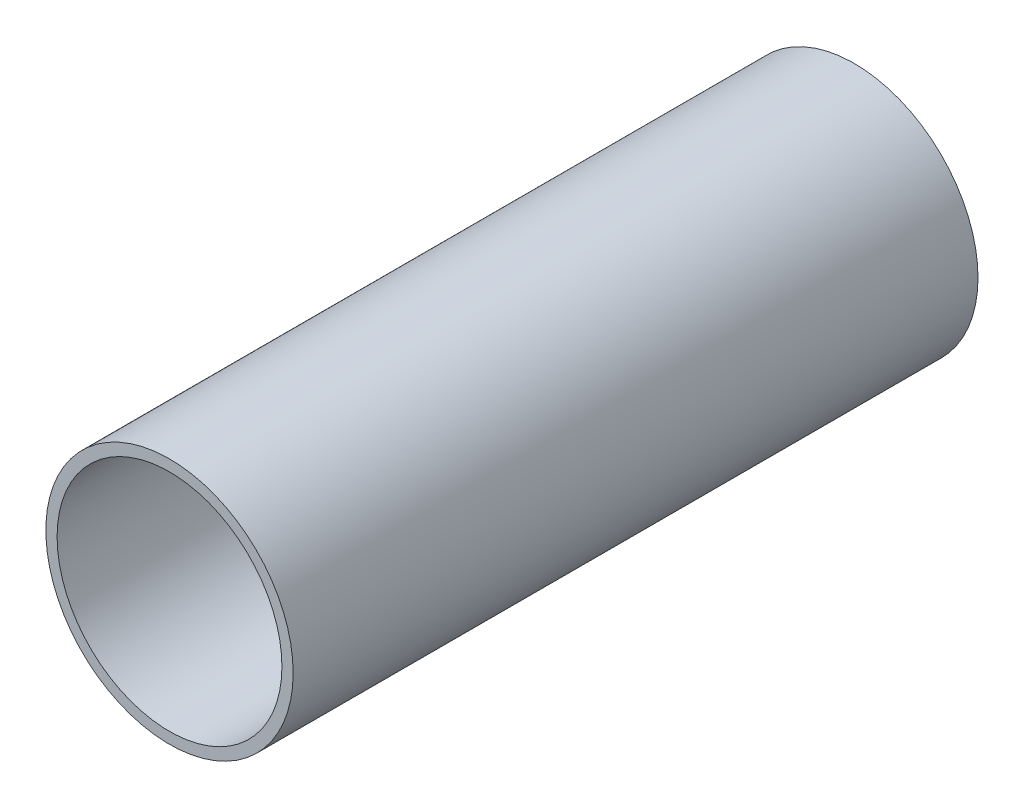
ISO-10303-21;
HEADER;
FILE_DESCRIPTION(('STEP AP214'),'2;1');
FILE_NAME('part.step','',(''),(''),'','','');
FILE_SCHEMA(('AUTOMOTIVE_DESIGN { 1 0 10303 214 1 1 1 1 }'));
ENDSEC;
DATA;
#1=APPLICATION_CONTEXT('core data for automotive mechanical design processes');
#2=APPLICATION_PROTOCOL_DEFINITION('international standard','automotive_design',2000,#1);
#3=PRODUCT_CONTEXT('',#1,'mechanical');
#4=PRODUCT('Part','Part','',(#3));
#5=PRODUCT_RELATED_PRODUCT_CATEGORY('part','',(#4));
#6=PRODUCT_DEFINITION_FORMATION('','',#4);
#7=PRODUCT_DEFINITION_CONTEXT('part definition',#1,'design');
#8=PRODUCT_DEFINITION('design','',#6,#7);
#9=PRODUCT_DEFINITION_SHAPE('','',#8);
#10=(LENGTH_UNIT() NAMED_UNIT(*) SI_UNIT(.MILLI.,.METRE.));
#11=(NAMED_UNIT(*) PLANE_ANGLE_UNIT() SI_UNIT($,.RADIAN.));
#12=(NAMED_UNIT(*) SI_UNIT($,.STERADIAN.) SOLID_ANGLE_UNIT());
#13=UNCERTAINTY_MEASURE_WITH_UNIT(LENGTH_MEASURE(1.E-05),#10,'distance_accuracy_value','');
#14=(GEOMETRIC_REPRESENTATION_CONTEXT(3) GLOBAL_UNCERTAINTY_ASSIGNED_CONTEXT((#13)) GLOBAL_UNIT_ASSIGNED_CONTEXT((#10,
#11,#12)) REPRESENTATION_CONTEXT('',''));
#15=CARTESIAN_POINT('',(0.,0.,0.));
#16=DIRECTION('',(0.,0.,1.));
#17=DIRECTION('',(1.,0.,0.));
#18=AXIS2_PLACEMENT_3D('',#15,#16,#17);
#19=CARTESIAN_POINT('',(0.,0.,228.6));
#20=DIRECTION('',(0.,0.,-1.));
#21=DIRECTION('',(-1.,0.,0.));
#22=AXIS2_PLACEMENT_3D('',#19,#20,#21);
#23=PLANE('',#22);
#24=CARTESIAN_POINT('',(0.,0.,228.6));
#25=DIRECTION('',(0.,0.,-1.));
#26=DIRECTION('',(-1.,0.,0.));
#27=AXIS2_PLACEMENT_3D('',#24,#25,#26);
#28=CIRCLE('',#27,75.05);
#29=CARTESIAN_POINT('',(-75.05,0.,228.6));
#30=VERTEX_POINT('',#29);
#31=EDGE_CURVE('E52',#30,#30,#28,.F.);
#32=ORIENTED_EDGE('',*,*,#31,.F.);
#33=EDGE_LOOP('',(#32));
#34=FACE_BOUND('',#33,.T.);
#35=CARTESIAN_POINT('',(0.,0.,228.6));
#36=DIRECTION('',(0.,0.,1.));
#37=DIRECTION('',(1.,0.,0.));
#38=AXIS2_PLACEMENT_3D('',#35,#36,#37);
#39=CIRCLE('',#38,82.55);
#40=CARTESIAN_POINT('',(82.55,0.,228.6));
#41=VERTEX_POINT('',#40);
#42=EDGE_CURVE('E10',#41,#41,#39,.T.);
#43=ORIENTED_EDGE('',*,*,#42,.T.);
#44=EDGE_LOOP('',(#43));
#45=FACE_BOUND('',#44,.T.);
#46=ADVANCED_FACE('F40',(#34,#45),#23,.F.);
#47=CARTESIAN_POINT('',(0.,0.,228.6));
#48=DIRECTION('',(0.,0.,1.));
#49=DIRECTION('',(1.,0.,0.));
#50=AXIS2_PLACEMENT_3D('',#47,#48,#49);
#51=CYLINDRICAL_SURFACE('',#50,82.55);
#52=ORIENTED_EDGE('',*,*,#42,.F.);
#53=EDGE_LOOP('',(#52));
#54=FACE_BOUND('',#53,.T.);
#55=CARTESIAN_POINT('',(0.,0.,-228.6));
#56=DIRECTION('',(0.,0.,1.));
#57=DIRECTION('',(1.,0.,0.));
#58=AXIS2_PLACEMENT_3D('',#55,#56,#57);
#59=CIRCLE('',#58,82.5500000000001);
#60=CARTESIAN_POINT('',(82.5500000000001,0.,-228.6));
#61=VERTEX_POINT('',#60);
#62=EDGE_CURVE('E47',#61,#61,#59,.T.);
#63=ORIENTED_EDGE('',*,*,#62,.T.);
#64=EDGE_LOOP('',(#63));
#65=FACE_BOUND('',#64,.T.);
#66=ADVANCED_FACE('F74',(#54,#65),#51,.T.);
#67=CARTESIAN_POINT('',(0.,82.5500000000001,-228.6));
#68=DIRECTION('',(0.,0.,1.));
#69=DIRECTION('',(1.,0.,0.));
#70=AXIS2_PLACEMENT_3D('',#67,#68,#69);
#71=PLANE('',#70);
#72=CARTESIAN_POINT('',(0.,0.,-228.6));
#73=DIRECTION('',(0.,0.,1.));
#74=DIRECTION('',(1.,0.,0.));
#75=AXIS2_PLACEMENT_3D('',#72,#73,#74);
#76=CIRCLE('',#75,75.05);
#77=CARTESIAN_POINT('',(75.05,0.,-228.6));
#78=VERTEX_POINT('',#77);
#79=EDGE_CURVE('E57',#78,#78,#76,.T.);
#80=ORIENTED_EDGE('',*,*,#79,.T.);
#81=EDGE_LOOP('',(#80));
#82=FACE_BOUND('',#81,.T.);
#83=ORIENTED_EDGE('',*,*,#62,.F.);
#84=EDGE_LOOP('',(#83));
#85=FACE_BOUND('',#84,.T.);
#86=ADVANCED_FACE('F64',(#82,#85),#71,.F.);
#87=CARTESIAN_POINT('',(0.,0.,228.6));
#88=DIRECTION('',(0.,0.,1.));
#89=DIRECTION('',(1.,0.,0.));
#90=AXIS2_PLACEMENT_3D('',#87,#88,#89);
#91=CYLINDRICAL_SURFACE('',#90,75.05);
#92=ORIENTED_EDGE('',*,*,#31,.T.);
#93=EDGE_LOOP('',(#92));
#94=FACE_BOUND('',#93,.T.);
#95=ORIENTED_EDGE('',*,*,#79,.F.);
#96=EDGE_LOOP('',(#95));
#97=FACE_BOUND('',#96,.T.);
#98=ADVANCED_FACE('F67',(#94,#97),#91,.F.);
#99=CLOSED_SHELL('',(#46,#66,#86,#98));
#100=MANIFOLD_SOLID_BREP('B2',#99);
#101=ADVANCED_BREP_SHAPE_REPRESENTATION('',(#18,#100),#14);
#102=SHAPE_DEFINITION_REPRESENTATION(#9,#101);
ENDSEC;
END-ISO-10303-21;
